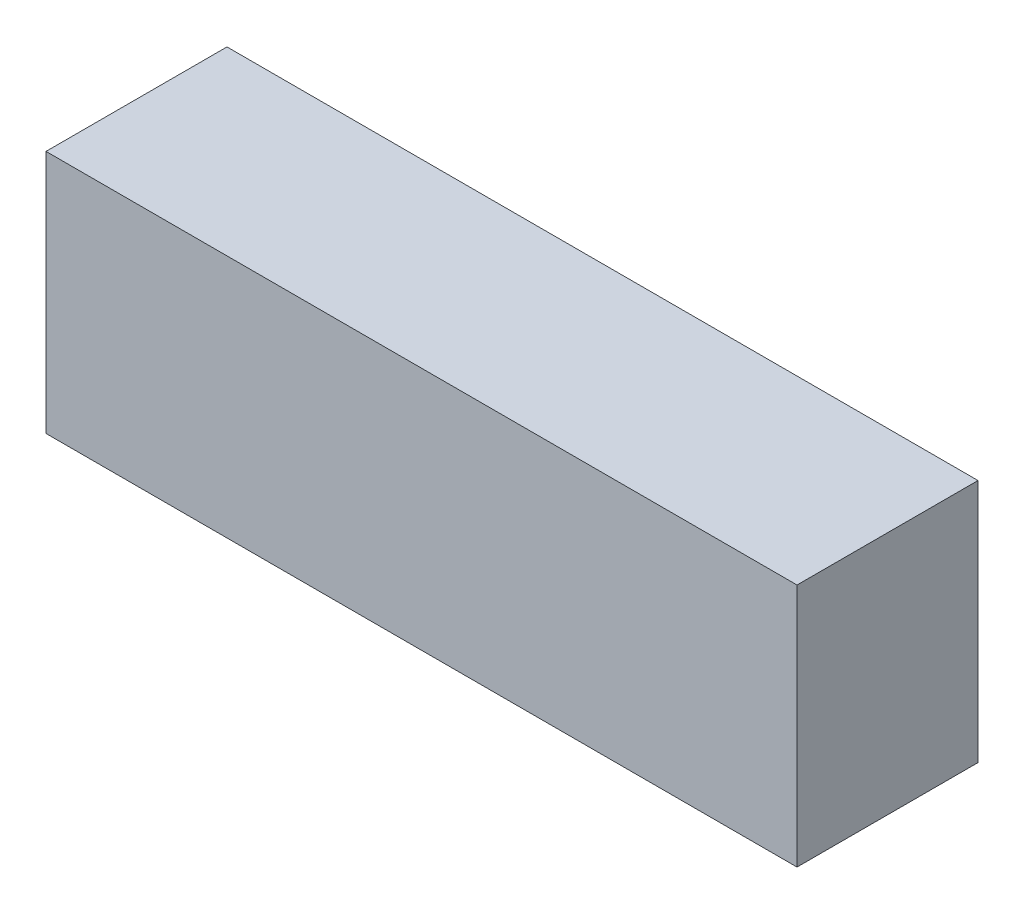
ISO-10303-21;
HEADER;
FILE_DESCRIPTION(('STEP AP214'),'2;1');
FILE_NAME('part.step','',(''),(''),'','','');
FILE_SCHEMA(('AUTOMOTIVE_DESIGN { 1 0 10303 214 1 1 1 1 }'));
ENDSEC;
DATA;
#1=APPLICATION_CONTEXT('core data for automotive mechanical design processes');
#2=APPLICATION_PROTOCOL_DEFINITION('international standard','automotive_design',2000,#1);
#3=PRODUCT_CONTEXT('',#1,'mechanical');
#4=PRODUCT('Part','Part','',(#3));
#5=PRODUCT_RELATED_PRODUCT_CATEGORY('part','',(#4));
#6=PRODUCT_DEFINITION_FORMATION('','',#4);
#7=PRODUCT_DEFINITION_CONTEXT('part definition',#1,'design');
#8=PRODUCT_DEFINITION('design','',#6,#7);
#9=PRODUCT_DEFINITION_SHAPE('','',#8);
#10=(LENGTH_UNIT() NAMED_UNIT(*) SI_UNIT(.MILLI.,.METRE.));
#11=(NAMED_UNIT(*) PLANE_ANGLE_UNIT() SI_UNIT($,.RADIAN.));
#12=(NAMED_UNIT(*) SI_UNIT($,.STERADIAN.) SOLID_ANGLE_UNIT());
#13=UNCERTAINTY_MEASURE_WITH_UNIT(LENGTH_MEASURE(1.E-05),#10,'distance_accuracy_value','');
#14=(GEOMETRIC_REPRESENTATION_CONTEXT(3) GLOBAL_UNCERTAINTY_ASSIGNED_CONTEXT((#13)) GLOBAL_UNIT_ASSIGNED_CONTEXT((#10,
#11,#12)) REPRESENTATION_CONTEXT('',''));
#15=CARTESIAN_POINT('',(0.,0.,0.));
#16=DIRECTION('',(0.,0.,1.));
#17=DIRECTION('',(1.,0.,0.));
#18=AXIS2_PLACEMENT_3D('',#15,#16,#17);
#19=CARTESIAN_POINT('',(0.,5.00000000000402,-17.2));
#20=DIRECTION('',(0.,1.,0.));
#21=DIRECTION('',(1.,0.,0.));
#22=AXIS2_PLACEMENT_3D('',#19,#20,#21);
#23=PLANE('',#22);
#24=DIRECTION('',(-1.,0.,0.));
#25=VECTOR('',#24,1.);
#26=CARTESIAN_POINT('',(4.15,5.00000000000402,-16.2));
#27=LINE('',#26,#25);
#28=CARTESIAN_POINT('',(4.15,5.00000000000402,-16.2));
#29=VERTEX_POINT('',#28);
#30=CARTESIAN_POINT('',(-4.15,5.00000000000402,-16.2));
#31=VERTEX_POINT('',#30);
#32=EDGE_CURVE('E26',#29,#31,#27,.T.);
#33=ORIENTED_EDGE('',*,*,#32,.T.);
#34=DIRECTION('',(0.,0.,-1.));
#35=VECTOR('',#34,1.);
#36=CARTESIAN_POINT('',(-4.15,5.00000000000402,-16.2));
#37=LINE('',#36,#35);
#38=CARTESIAN_POINT('',(-4.15,5.00000000000402,-18.2));
#39=VERTEX_POINT('',#38);
#40=EDGE_CURVE('E78',#31,#39,#37,.T.);
#41=ORIENTED_EDGE('',*,*,#40,.T.);
#42=DIRECTION('',(1.,0.,0.));
#43=VECTOR('',#42,1.);
#44=CARTESIAN_POINT('',(-4.15,5.00000000000402,-18.2));
#45=LINE('',#44,#43);
#46=CARTESIAN_POINT('',(4.15,5.00000000000402,-18.2));
#47=VERTEX_POINT('',#46);
#48=EDGE_CURVE('E99',#39,#47,#45,.T.);
#49=ORIENTED_EDGE('',*,*,#48,.T.);
#50=DIRECTION('',(0.,0.,1.));
#51=VECTOR('',#50,1.);
#52=CARTESIAN_POINT('',(4.15,5.00000000000402,-18.2));
#53=LINE('',#52,#51);
#54=EDGE_CURVE('E79',#47,#29,#53,.T.);
#55=ORIENTED_EDGE('',*,*,#54,.T.);
#56=EDGE_LOOP('',(#33,#41,#49,#55));
#57=FACE_BOUND('',#56,.T.);
#58=ADVANCED_FACE('F16',(#57),#23,.F.);
#59=CARTESIAN_POINT('',(0.,7.70000000000402,-17.2));
#60=DIRECTION('',(0.,1.,0.));
#61=DIRECTION('',(1.,0.,0.));
#62=AXIS2_PLACEMENT_3D('',#59,#60,#61);
#63=PLANE('',#62);
#64=DIRECTION('',(1.,0.,0.));
#65=VECTOR('',#64,1.);
#66=CARTESIAN_POINT('',(4.15,7.70000000000402,-16.2));
#67=LINE('',#66,#65);
#68=CARTESIAN_POINT('',(-4.15,7.70000000000402,-16.2));
#69=VERTEX_POINT('',#68);
#70=CARTESIAN_POINT('',(4.15,7.70000000000402,-16.2));
#71=VERTEX_POINT('',#70);
#72=EDGE_CURVE('E11',#69,#71,#67,.T.);
#73=ORIENTED_EDGE('',*,*,#72,.T.);
#74=DIRECTION('',(0.,0.,-1.));
#75=VECTOR('',#74,1.);
#76=CARTESIAN_POINT('',(4.15,7.70000000000402,-18.2));
#77=LINE('',#76,#75);
#78=CARTESIAN_POINT('',(4.15,7.70000000000402,-18.2));
#79=VERTEX_POINT('',#78);
#80=EDGE_CURVE('E98',#71,#79,#77,.T.);
#81=ORIENTED_EDGE('',*,*,#80,.T.);
#82=DIRECTION('',(-1.,0.,0.));
#83=VECTOR('',#82,1.);
#84=CARTESIAN_POINT('',(-4.15,7.70000000000402,-18.2));
#85=LINE('',#84,#83);
#86=CARTESIAN_POINT('',(-4.15,7.70000000000402,-18.2));
#87=VERTEX_POINT('',#86);
#88=EDGE_CURVE('E64',#79,#87,#85,.T.);
#89=ORIENTED_EDGE('',*,*,#88,.T.);
#90=DIRECTION('',(0.,0.,1.));
#91=VECTOR('',#90,1.);
#92=CARTESIAN_POINT('',(-4.15,7.70000000000402,-16.2));
#93=LINE('',#92,#91);
#94=EDGE_CURVE('E87',#87,#69,#93,.T.);
#95=ORIENTED_EDGE('',*,*,#94,.T.);
#96=EDGE_LOOP('',(#73,#81,#89,#95));
#97=FACE_BOUND('',#96,.T.);
#98=ADVANCED_FACE('F155',(#97),#63,.T.);
#99=CARTESIAN_POINT('',(-4.15,5.00000000000402,-16.2));
#100=DIRECTION('',(0.,0.,1.));
#101=DIRECTION('',(1.,0.,0.));
#102=AXIS2_PLACEMENT_3D('',#99,#100,#101);
#103=PLANE('',#102);
#104=ORIENTED_EDGE('',*,*,#32,.F.);
#105=DIRECTION('',(0.,1.,0.));
#106=VECTOR('',#105,1.);
#107=CARTESIAN_POINT('',(4.15,5.00000000000402,-16.2));
#108=LINE('',#107,#106);
#109=EDGE_CURVE('E81',#29,#71,#108,.T.);
#110=ORIENTED_EDGE('',*,*,#109,.T.);
#111=ORIENTED_EDGE('',*,*,#72,.F.);
#112=DIRECTION('',(0.,1.,0.));
#113=VECTOR('',#112,1.);
#114=CARTESIAN_POINT('',(-4.15,5.00000000000402,-16.2));
#115=LINE('',#114,#113);
#116=EDGE_CURVE('E83',#31,#69,#115,.T.);
#117=ORIENTED_EDGE('',*,*,#116,.F.);
#118=EDGE_LOOP('',(#104,#110,#111,#117));
#119=FACE_BOUND('',#118,.T.);
#120=ADVANCED_FACE('F18',(#119),#103,.T.);
#121=CARTESIAN_POINT('',(4.15,5.00000000000402,-16.2));
#122=DIRECTION('',(1.,0.,0.));
#123=DIRECTION('',(0.,0.,-1.));
#124=AXIS2_PLACEMENT_3D('',#121,#122,#123);
#125=PLANE('',#124);
#126=ORIENTED_EDGE('',*,*,#54,.F.);
#127=DIRECTION('',(0.,1.,0.));
#128=VECTOR('',#127,1.);
#129=CARTESIAN_POINT('',(4.15,5.00000000000402,-18.2));
#130=LINE('',#129,#128);
#131=EDGE_CURVE('E106',#47,#79,#130,.T.);
#132=ORIENTED_EDGE('',*,*,#131,.T.);
#133=ORIENTED_EDGE('',*,*,#80,.F.);
#134=ORIENTED_EDGE('',*,*,#109,.F.);
#135=EDGE_LOOP('',(#126,#132,#133,#134));
#136=FACE_BOUND('',#135,.T.);
#137=ADVANCED_FACE('F158',(#136),#125,.T.);
#138=CARTESIAN_POINT('',(4.15,5.00000000000402,-18.2));
#139=DIRECTION('',(0.,0.,-1.));
#140=DIRECTION('',(0.,-1.,0.));
#141=AXIS2_PLACEMENT_3D('',#138,#139,#140);
#142=PLANE('',#141);
#143=ORIENTED_EDGE('',*,*,#48,.F.);
#144=DIRECTION('',(0.,1.,0.));
#145=VECTOR('',#144,1.);
#146=CARTESIAN_POINT('',(-4.15,5.00000000000402,-18.2));
#147=LINE('',#146,#145);
#148=EDGE_CURVE('E20',#39,#87,#147,.T.);
#149=ORIENTED_EDGE('',*,*,#148,.T.);
#150=ORIENTED_EDGE('',*,*,#88,.F.);
#151=ORIENTED_EDGE('',*,*,#131,.F.);
#152=EDGE_LOOP('',(#143,#149,#150,#151));
#153=FACE_BOUND('',#152,.T.);
#154=ADVANCED_FACE('F160',(#153),#142,.T.);
#155=CARTESIAN_POINT('',(-4.15,5.00000000000402,-18.2));
#156=DIRECTION('',(-1.,0.,0.));
#157=DIRECTION('',(0.,1.,0.));
#158=AXIS2_PLACEMENT_3D('',#155,#156,#157);
#159=PLANE('',#158);
#160=ORIENTED_EDGE('',*,*,#40,.F.);
#161=ORIENTED_EDGE('',*,*,#116,.T.);
#162=ORIENTED_EDGE('',*,*,#94,.F.);
#163=ORIENTED_EDGE('',*,*,#148,.F.);
#164=EDGE_LOOP('',(#160,#161,#162,#163));
#165=FACE_BOUND('',#164,.T.);
#166=ADVANCED_FACE('F90',(#165),#159,.T.);
#167=CLOSED_SHELL('',(#58,#98,#120,#137,#154,#166));
#168=MANIFOLD_SOLID_BREP('B1',#167);
#169=ADVANCED_BREP_SHAPE_REPRESENTATION('',(#18,#168),#14);
#170=SHAPE_DEFINITION_REPRESENTATION(#9,#169);
ENDSEC;
END-ISO-10303-21;
